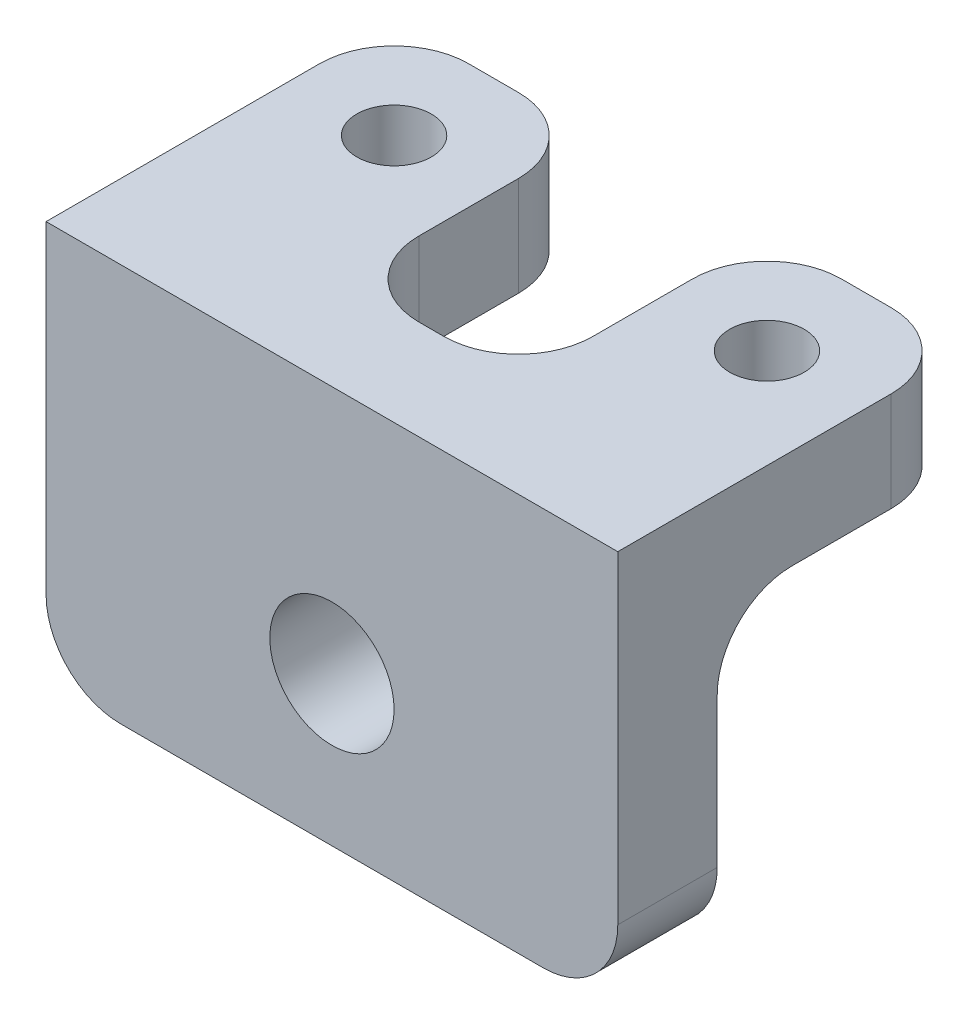
ISO-10303-21;
HEADER;
FILE_DESCRIPTION(('STEP AP214'),'2;1');
FILE_NAME('part.step','',(''),(''),'','','');
FILE_SCHEMA(('AUTOMOTIVE_DESIGN { 1 0 10303 214 1 1 1 1 }'));
ENDSEC;
DATA;
#1=APPLICATION_CONTEXT('core data for automotive mechanical design processes');
#2=APPLICATION_PROTOCOL_DEFINITION('international standard','automotive_design',2000,#1);
#3=PRODUCT_CONTEXT('',#1,'mechanical');
#4=PRODUCT('Part','Part','',(#3));
#5=PRODUCT_RELATED_PRODUCT_CATEGORY('part','',(#4));
#6=PRODUCT_DEFINITION_FORMATION('','',#4);
#7=PRODUCT_DEFINITION_CONTEXT('part definition',#1,'design');
#8=PRODUCT_DEFINITION('design','',#6,#7);
#9=PRODUCT_DEFINITION_SHAPE('','',#8);
#10=(LENGTH_UNIT() NAMED_UNIT(*) SI_UNIT(.MILLI.,.METRE.));
#11=(NAMED_UNIT(*) PLANE_ANGLE_UNIT() SI_UNIT($,.RADIAN.));
#12=(NAMED_UNIT(*) SI_UNIT($,.STERADIAN.) SOLID_ANGLE_UNIT());
#13=UNCERTAINTY_MEASURE_WITH_UNIT(LENGTH_MEASURE(1.E-05),#10,'distance_accuracy_value','');
#14=(GEOMETRIC_REPRESENTATION_CONTEXT(3) GLOBAL_UNCERTAINTY_ASSIGNED_CONTEXT((#13)) GLOBAL_UNIT_ASSIGNED_CONTEXT((#10,
#11,#12)) REPRESENTATION_CONTEXT('',''));
#15=CARTESIAN_POINT('',(0.,0.,0.));
#16=DIRECTION('',(0.,0.,1.));
#17=DIRECTION('',(1.,0.,0.));
#18=AXIS2_PLACEMENT_3D('',#15,#16,#17);
#19=CARTESIAN_POINT('',(0.,0.,0.));
#20=DIRECTION('',(0.,1.,0.));
#21=DIRECTION('',(0.,0.,1.));
#22=AXIS2_PLACEMENT_3D('',#19,#20,#21);
#23=PLANE('',#22);
#24=CARTESIAN_POINT('',(7.5,0.,-6.));
#25=DIRECTION('',(0.,1.,0.));
#26=DIRECTION('',(0.,0.,1.));
#27=AXIS2_PLACEMENT_3D('',#24,#25,#26);
#28=CIRCLE('',#27,1.5);
#29=CARTESIAN_POINT('',(7.5,0.,-4.5));
#30=VERTEX_POINT('',#29);
#31=EDGE_CURVE('E351',#30,#30,#28,.T.);
#32=ORIENTED_EDGE('',*,*,#31,.T.);
#33=EDGE_LOOP('',(#32));
#34=FACE_BOUND('',#33,.T.);
#35=DIRECTION('',(0.,0.,-1.));
#36=VECTOR('',#35,1.);
#37=CARTESIAN_POINT('',(11.5,0.,-10.));
#38=LINE('',#37,#36);
#39=CARTESIAN_POINT('',(11.5,0.,-3.));
#40=VERTEX_POINT('',#39);
#41=CARTESIAN_POINT('',(11.5,0.,-7.));
#42=VERTEX_POINT('',#41);
#43=EDGE_CURVE('E218',#40,#42,#38,.T.);
#44=ORIENTED_EDGE('',*,*,#43,.F.);
#45=DIRECTION('',(-1.,0.,0.));
#46=VECTOR('',#45,1.);
#47=CARTESIAN_POINT('',(3.5,0.,-3.));
#48=LINE('',#47,#46);
#49=CARTESIAN_POINT('',(3.5,0.,-3.));
#50=VERTEX_POINT('',#49);
#51=EDGE_CURVE('E250',#40,#50,#48,.T.);
#52=ORIENTED_EDGE('',*,*,#51,.T.);
#53=DIRECTION('',(0.,0.,1.));
#54=VECTOR('',#53,1.);
#55=CARTESIAN_POINT('',(3.5,0.,0.));
#56=LINE('',#55,#54);
#57=CARTESIAN_POINT('',(3.5,0.,-7.));
#58=VERTEX_POINT('',#57);
#59=EDGE_CURVE('E223',#58,#50,#56,.T.);
#60=ORIENTED_EDGE('',*,*,#59,.F.);
#61=CARTESIAN_POINT('',(6.5,0.,-7.));
#62=DIRECTION('',(0.,1.,0.));
#63=DIRECTION('',(0.,0.,1.));
#64=AXIS2_PLACEMENT_3D('',#61,#62,#63);
#65=CIRCLE('',#64,3.);
#66=CARTESIAN_POINT('',(6.5,0.,-10.));
#67=VERTEX_POINT('',#66);
#68=EDGE_CURVE('E248',#58,#67,#65,.F.);
#69=ORIENTED_EDGE('',*,*,#68,.T.);
#70=DIRECTION('',(-1.,0.,0.));
#71=VECTOR('',#70,1.);
#72=CARTESIAN_POINT('',(3.5,0.,-10.));
#73=LINE('',#72,#71);
#74=CARTESIAN_POINT('',(8.5,0.,-10.));
#75=VERTEX_POINT('',#74);
#76=EDGE_CURVE('E221',#75,#67,#73,.T.);
#77=ORIENTED_EDGE('',*,*,#76,.F.);
#78=CARTESIAN_POINT('',(8.5,0.,-7.));
#79=DIRECTION('',(0.,1.,0.));
#80=DIRECTION('',(0.,0.,1.));
#81=AXIS2_PLACEMENT_3D('',#78,#79,#80);
#82=CIRCLE('',#81,3.);
#83=EDGE_CURVE('E246',#75,#42,#82,.F.);
#84=ORIENTED_EDGE('',*,*,#83,.T.);
#85=EDGE_LOOP('',(#44,#52,#60,#69,#77,#84));
#86=FACE_BOUND('',#85,.T.);
#87=ADVANCED_FACE('F33',(#34,#86),#23,.F.);
#88=CARTESIAN_POINT('',(0.,4.,0.));
#89=DIRECTION('',(0.,1.,0.));
#90=DIRECTION('',(0.,0.,1.));
#91=AXIS2_PLACEMENT_3D('',#88,#89,#90);
#92=PLANE('',#91);
#93=CARTESIAN_POINT('',(-7.5,4.,-6.));
#94=DIRECTION('',(0.,1.,0.));
#95=DIRECTION('',(0.,0.,1.));
#96=AXIS2_PLACEMENT_3D('',#93,#94,#95);
#97=CIRCLE('',#96,1.5);
#98=CARTESIAN_POINT('',(-7.5,4.,-4.5));
#99=VERTEX_POINT('',#98);
#100=EDGE_CURVE('E212',#99,#99,#97,.T.);
#101=ORIENTED_EDGE('',*,*,#100,.F.);
#102=EDGE_LOOP('',(#101));
#103=FACE_BOUND('',#102,.T.);
#104=DIRECTION('',(-1.,0.,0.));
#105=VECTOR('',#104,1.);
#106=CARTESIAN_POINT('',(-11.5,4.,-10.));
#107=LINE('',#106,#105);
#108=CARTESIAN_POINT('',(-6.5,4.,-10.));
#109=VERTEX_POINT('',#108);
#110=CARTESIAN_POINT('',(-8.5,4.,-10.));
#111=VERTEX_POINT('',#110);
#112=EDGE_CURVE('E178',#109,#111,#107,.T.);
#113=ORIENTED_EDGE('',*,*,#112,.T.);
#114=CARTESIAN_POINT('',(-8.5,4.,-7.));
#115=DIRECTION('',(0.,1.,0.));
#116=DIRECTION('',(0.,0.,1.));
#117=AXIS2_PLACEMENT_3D('',#114,#115,#116);
#118=CIRCLE('',#117,3.);
#119=CARTESIAN_POINT('',(-11.5,4.,-7.));
#120=VERTEX_POINT('',#119);
#121=EDGE_CURVE('E174',#111,#120,#118,.T.);
#122=ORIENTED_EDGE('',*,*,#121,.T.);
#123=DIRECTION('',(0.,0.,1.));
#124=VECTOR('',#123,1.);
#125=CARTESIAN_POINT('',(-11.5,4.,4.));
#126=LINE('',#125,#124);
#127=CARTESIAN_POINT('',(-11.5,4.,4.));
#128=VERTEX_POINT('',#127);
#129=EDGE_CURVE('E165',#120,#128,#126,.T.);
#130=ORIENTED_EDGE('',*,*,#129,.T.);
#131=DIRECTION('',(1.,0.,0.));
#132=VECTOR('',#131,1.);
#133=CARTESIAN_POINT('',(11.5,4.,4.));
#134=LINE('',#133,#132);
#135=CARTESIAN_POINT('',(11.5,4.,4.));
#136=VERTEX_POINT('',#135);
#137=EDGE_CURVE('E171',#128,#136,#134,.T.);
#138=ORIENTED_EDGE('',*,*,#137,.T.);
#139=DIRECTION('',(0.,0.,-1.));
#140=VECTOR('',#139,1.);
#141=CARTESIAN_POINT('',(11.5,4.,-10.));
#142=LINE('',#141,#140);
#143=CARTESIAN_POINT('',(11.5,4.,-7.));
#144=VERTEX_POINT('',#143);
#145=EDGE_CURVE('E195',#136,#144,#142,.T.);
#146=ORIENTED_EDGE('',*,*,#145,.T.);
#147=CARTESIAN_POINT('',(8.5,4.,-7.));
#148=DIRECTION('',(0.,1.,0.));
#149=DIRECTION('',(0.,0.,1.));
#150=AXIS2_PLACEMENT_3D('',#147,#148,#149);
#151=CIRCLE('',#150,3.);
#152=CARTESIAN_POINT('',(8.5,4.,-10.));
#153=VERTEX_POINT('',#152);
#154=EDGE_CURVE('E57',#144,#153,#151,.T.);
#155=ORIENTED_EDGE('',*,*,#154,.T.);
#156=DIRECTION('',(-1.,0.,0.));
#157=VECTOR('',#156,1.);
#158=CARTESIAN_POINT('',(3.5,4.,-10.));
#159=LINE('',#158,#157);
#160=CARTESIAN_POINT('',(6.5,4.,-10.));
#161=VERTEX_POINT('',#160);
#162=EDGE_CURVE('E197',#153,#161,#159,.T.);
#163=ORIENTED_EDGE('',*,*,#162,.T.);
#164=CARTESIAN_POINT('',(6.5,4.,-7.));
#165=DIRECTION('',(0.,1.,0.));
#166=DIRECTION('',(0.,0.,1.));
#167=AXIS2_PLACEMENT_3D('',#164,#165,#166);
#168=CIRCLE('',#167,3.);
#169=CARTESIAN_POINT('',(3.5,4.,-7.));
#170=VERTEX_POINT('',#169);
#171=EDGE_CURVE('E284',#161,#170,#168,.T.);
#172=ORIENTED_EDGE('',*,*,#171,.T.);
#173=DIRECTION('',(0.,0.,1.));
#174=VECTOR('',#173,1.);
#175=CARTESIAN_POINT('',(3.5,4.,0.));
#176=LINE('',#175,#174);
#177=CARTESIAN_POINT('',(3.5,4.,-3.));
#178=VERTEX_POINT('',#177);
#179=EDGE_CURVE('E202',#170,#178,#176,.T.);
#180=ORIENTED_EDGE('',*,*,#179,.T.);
#181=CARTESIAN_POINT('',(0.5,4.,-3.));
#182=DIRECTION('',(0.,1.,0.));
#183=DIRECTION('',(0.,0.,1.));
#184=AXIS2_PLACEMENT_3D('',#181,#182,#183);
#185=CIRCLE('',#184,3.);
#186=CARTESIAN_POINT('',(0.5,4.,0.));
#187=VERTEX_POINT('',#186);
#188=EDGE_CURVE('E42',#178,#187,#185,.F.);
#189=ORIENTED_EDGE('',*,*,#188,.T.);
#190=DIRECTION('',(-1.,0.,0.));
#191=VECTOR('',#190,1.);
#192=CARTESIAN_POINT('',(-3.5,4.,0.));
#193=LINE('',#192,#191);
#194=CARTESIAN_POINT('',(-0.499999999999999,4.,0.));
#195=VERTEX_POINT('',#194);
#196=EDGE_CURVE('E205',#187,#195,#193,.T.);
#197=ORIENTED_EDGE('',*,*,#196,.T.);
#198=CARTESIAN_POINT('',(-0.499999999999999,4.,-3.));
#199=DIRECTION('',(0.,1.,0.));
#200=DIRECTION('',(0.,0.,1.));
#201=AXIS2_PLACEMENT_3D('',#198,#199,#200);
#202=CIRCLE('',#201,3.);
#203=CARTESIAN_POINT('',(-3.5,4.,-3.));
#204=VERTEX_POINT('',#203);
#205=EDGE_CURVE('E11',#195,#204,#202,.F.);
#206=ORIENTED_EDGE('',*,*,#205,.T.);
#207=DIRECTION('',(0.,0.,-1.));
#208=VECTOR('',#207,1.);
#209=CARTESIAN_POINT('',(-3.5,4.,-10.));
#210=LINE('',#209,#208);
#211=CARTESIAN_POINT('',(-3.5,4.,-7.));
#212=VERTEX_POINT('',#211);
#213=EDGE_CURVE('E226',#204,#212,#210,.T.);
#214=ORIENTED_EDGE('',*,*,#213,.T.);
#215=CARTESIAN_POINT('',(-6.5,4.,-7.));
#216=DIRECTION('',(0.,1.,0.));
#217=DIRECTION('',(0.,0.,1.));
#218=AXIS2_PLACEMENT_3D('',#215,#216,#217);
#219=CIRCLE('',#218,3.);
#220=EDGE_CURVE('E286',#212,#109,#219,.T.);
#221=ORIENTED_EDGE('',*,*,#220,.T.);
#222=EDGE_LOOP('',(#113,#122,#130,#138,#146,#155,#163,#172,#180,#189,#197,#206,#214,#221));
#223=FACE_BOUND('',#222,.T.);
#224=CARTESIAN_POINT('',(7.5,4.,-6.));
#225=DIRECTION('',(0.,1.,0.));
#226=DIRECTION('',(0.,0.,1.));
#227=AXIS2_PLACEMENT_3D('',#224,#225,#226);
#228=CIRCLE('',#227,1.5);
#229=CARTESIAN_POINT('',(7.5,4.,-4.5));
#230=VERTEX_POINT('',#229);
#231=EDGE_CURVE('E353',#230,#230,#228,.T.);
#232=ORIENTED_EDGE('',*,*,#231,.F.);
#233=EDGE_LOOP('',(#232));
#234=FACE_BOUND('',#233,.T.);
#235=ADVANCED_FACE('F168',(#103,#223,#234),#92,.T.);
#236=DIRECTION('',(0.,0.,-1.));
#237=VECTOR('',#236,1.);
#238=CARTESIAN_POINT('',(-3.5,0.,-10.));
#239=LINE('',#238,#237);
#240=CARTESIAN_POINT('',(-3.5,0.,-3.));
#241=VERTEX_POINT('',#240);
#242=CARTESIAN_POINT('',(-3.5,0.,-7.));
#243=VERTEX_POINT('',#242);
#244=EDGE_CURVE('E208',#241,#243,#239,.T.);
#245=ORIENTED_EDGE('',*,*,#244,.F.);
#246=DIRECTION('',(-1.,0.,0.));
#247=VECTOR('',#246,1.);
#248=CARTESIAN_POINT('',(-11.5,0.,-3.));
#249=LINE('',#248,#247);
#250=CARTESIAN_POINT('',(-11.5,0.,-3.));
#251=VERTEX_POINT('',#250);
#252=EDGE_CURVE('E231',#241,#251,#249,.T.);
#253=ORIENTED_EDGE('',*,*,#252,.T.);
#254=DIRECTION('',(0.,0.,1.));
#255=VECTOR('',#254,1.);
#256=CARTESIAN_POINT('',(-11.5,0.,4.));
#257=LINE('',#256,#255);
#258=CARTESIAN_POINT('',(-11.5,0.,-7.));
#259=VERTEX_POINT('',#258);
#260=EDGE_CURVE('E215',#259,#251,#257,.T.);
#261=ORIENTED_EDGE('',*,*,#260,.F.);
#262=CARTESIAN_POINT('',(-8.5,0.,-7.));
#263=DIRECTION('',(0.,1.,0.));
#264=DIRECTION('',(0.,0.,1.));
#265=AXIS2_PLACEMENT_3D('',#262,#263,#264);
#266=CIRCLE('',#265,3.);
#267=CARTESIAN_POINT('',(-8.5,0.,-10.));
#268=VERTEX_POINT('',#267);
#269=EDGE_CURVE('E229',#259,#268,#266,.F.);
#270=ORIENTED_EDGE('',*,*,#269,.T.);
#271=DIRECTION('',(-1.,0.,0.));
#272=VECTOR('',#271,1.);
#273=CARTESIAN_POINT('',(-11.5,0.,-10.));
#274=LINE('',#273,#272);
#275=CARTESIAN_POINT('',(-6.5,0.,-10.));
#276=VERTEX_POINT('',#275);
#277=EDGE_CURVE('E211',#276,#268,#274,.T.);
#278=ORIENTED_EDGE('',*,*,#277,.F.);
#279=CARTESIAN_POINT('',(-6.5,0.,-7.));
#280=DIRECTION('',(0.,1.,0.));
#281=DIRECTION('',(0.,0.,1.));
#282=AXIS2_PLACEMENT_3D('',#279,#280,#281);
#283=CIRCLE('',#282,3.);
#284=EDGE_CURVE('E188',#276,#243,#283,.F.);
#285=ORIENTED_EDGE('',*,*,#284,.T.);
#286=EDGE_LOOP('',(#245,#253,#261,#270,#278,#285));
#287=FACE_BOUND('',#286,.T.);
#288=CARTESIAN_POINT('',(-7.5,0.,-6.));
#289=DIRECTION('',(0.,1.,0.));
#290=DIRECTION('',(0.,0.,1.));
#291=AXIS2_PLACEMENT_3D('',#288,#289,#290);
#292=CIRCLE('',#291,1.5);
#293=CARTESIAN_POINT('',(-7.5,0.,-4.5));
#294=VERTEX_POINT('',#293);
#295=EDGE_CURVE('E356',#294,#294,#292,.T.);
#296=ORIENTED_EDGE('',*,*,#295,.T.);
#297=EDGE_LOOP('',(#296));
#298=FACE_BOUND('',#297,.T.);
#299=ADVANCED_FACE('F374',(#287,#298),#23,.F.);
#300=CARTESIAN_POINT('',(-3.5,4.,-10.));
#301=DIRECTION('',(-1.,0.,0.));
#302=DIRECTION('',(0.,0.,1.));
#303=AXIS2_PLACEMENT_3D('',#300,#301,#302);
#304=PLANE('',#303);
#305=ORIENTED_EDGE('',*,*,#213,.F.);
#306=DIRECTION('',(0.,-1.,0.));
#307=VECTOR('',#306,1.);
#308=CARTESIAN_POINT('',(-3.5,0.,-3.));
#309=LINE('',#308,#307);
#310=EDGE_CURVE('E276',#204,#241,#309,.T.);
#311=ORIENTED_EDGE('',*,*,#310,.T.);
#312=ORIENTED_EDGE('',*,*,#244,.T.);
#313=DIRECTION('',(0.,-1.,0.));
#314=VECTOR('',#313,1.);
#315=CARTESIAN_POINT('',(-3.5,4.,-7.));
#316=LINE('',#315,#314);
#317=EDGE_CURVE('E274',#243,#212,#316,.F.);
#318=ORIENTED_EDGE('',*,*,#317,.T.);
#319=EDGE_LOOP('',(#305,#311,#312,#318));
#320=FACE_BOUND('',#319,.T.);
#321=ADVANCED_FACE('F412',(#320),#304,.F.);
#322=CARTESIAN_POINT('',(-11.5,4.,-10.));
#323=DIRECTION('',(0.,0.,1.));
#324=DIRECTION('',(1.,0.,0.));
#325=AXIS2_PLACEMENT_3D('',#322,#323,#324);
#326=PLANE('',#325);
#327=ORIENTED_EDGE('',*,*,#277,.T.);
#328=DIRECTION('',(0.,-1.,0.));
#329=VECTOR('',#328,1.);
#330=CARTESIAN_POINT('',(-8.5,4.,-10.));
#331=LINE('',#330,#329);
#332=EDGE_CURVE('E281',#268,#111,#331,.F.);
#333=ORIENTED_EDGE('',*,*,#332,.T.);
#334=ORIENTED_EDGE('',*,*,#112,.F.);
#335=DIRECTION('',(0.,-1.,0.));
#336=VECTOR('',#335,1.);
#337=CARTESIAN_POINT('',(-6.5,4.,-10.));
#338=LINE('',#337,#336);
#339=EDGE_CURVE('E278',#109,#276,#338,.T.);
#340=ORIENTED_EDGE('',*,*,#339,.T.);
#341=EDGE_LOOP('',(#327,#333,#334,#340));
#342=FACE_BOUND('',#341,.T.);
#343=ADVANCED_FACE('F416',(#342),#326,.F.);
#344=CARTESIAN_POINT('',(-11.5,4.,4.));
#345=DIRECTION('',(1.,0.,0.));
#346=DIRECTION('',(0.,0.,-1.));
#347=AXIS2_PLACEMENT_3D('',#344,#345,#346);
#348=PLANE('',#347);
#349=DIRECTION('',(0.,-1.,0.));
#350=VECTOR('',#349,1.);
#351=CARTESIAN_POINT('',(-11.5,0.,0.));
#352=LINE('',#351,#350);
#353=CARTESIAN_POINT('',(-11.5,-3.,0.));
#354=VERTEX_POINT('',#353);
#355=CARTESIAN_POINT('',(-11.5,-9.,0.));
#356=VERTEX_POINT('',#355);
#357=EDGE_CURVE('E341',#354,#356,#352,.T.);
#358=ORIENTED_EDGE('',*,*,#357,.T.);
#359=DIRECTION('',(0.,0.,1.));
#360=VECTOR('',#359,1.);
#361=CARTESIAN_POINT('',(-11.5,-9.,4.));
#362=LINE('',#361,#360);
#363=CARTESIAN_POINT('',(-11.5,-9.,4.));
#364=VERTEX_POINT('',#363);
#365=EDGE_CURVE('E186',#356,#364,#362,.T.);
#366=ORIENTED_EDGE('',*,*,#365,.T.);
#367=DIRECTION('',(0.,-1.,0.));
#368=VECTOR('',#367,1.);
#369=CARTESIAN_POINT('',(-11.5,4.,4.));
#370=LINE('',#369,#368);
#371=EDGE_CURVE('E182',#128,#364,#370,.T.);
#372=ORIENTED_EDGE('',*,*,#371,.F.);
#373=ORIENTED_EDGE('',*,*,#129,.F.);
#374=DIRECTION('',(0.,-1.,0.));
#375=VECTOR('',#374,1.);
#376=CARTESIAN_POINT('',(-11.5,4.,-7.));
#377=LINE('',#376,#375);
#378=EDGE_CURVE('E253',#120,#259,#377,.T.);
#379=ORIENTED_EDGE('',*,*,#378,.T.);
#380=ORIENTED_EDGE('',*,*,#260,.T.);
#381=CARTESIAN_POINT('',(-11.5,-3.,-3.));
#382=DIRECTION('',(1.,0.,0.));
#383=DIRECTION('',(0.,0.,-1.));
#384=AXIS2_PLACEMENT_3D('',#381,#382,#383);
#385=CIRCLE('',#384,3.);
#386=EDGE_CURVE('E293',#251,#354,#385,.T.);
#387=ORIENTED_EDGE('',*,*,#386,.T.);
#388=EDGE_LOOP('',(#358,#366,#372,#373,#379,#380,#387));
#389=FACE_BOUND('',#388,.T.);
#390=ADVANCED_FACE('F184',(#389),#348,.F.);
#391=CARTESIAN_POINT('',(11.5,4.,4.));
#392=DIRECTION('',(0.,0.,-1.));
#393=DIRECTION('',(-1.,0.,0.));
#394=AXIS2_PLACEMENT_3D('',#391,#392,#393);
#395=PLANE('',#394);
#396=ORIENTED_EDGE('',*,*,#371,.T.);
#397=CARTESIAN_POINT('',(-8.5,-9.,4.));
#398=DIRECTION('',(0.,0.,-1.));
#399=DIRECTION('',(-1.,0.,0.));
#400=AXIS2_PLACEMENT_3D('',#397,#398,#399);
#401=CIRCLE('',#400,3.);
#402=CARTESIAN_POINT('',(-8.5,-12.,4.));
#403=VERTEX_POINT('',#402);
#404=EDGE_CURVE('E258',#364,#403,#401,.F.);
#405=ORIENTED_EDGE('',*,*,#404,.T.);
#406=DIRECTION('',(1.,0.,0.));
#407=VECTOR('',#406,1.);
#408=CARTESIAN_POINT('',(11.5,-12.,4.));
#409=LINE('',#408,#407);
#410=CARTESIAN_POINT('',(8.5,-12.,4.));
#411=VERTEX_POINT('',#410);
#412=EDGE_CURVE('E342',#403,#411,#409,.T.);
#413=ORIENTED_EDGE('',*,*,#412,.T.);
#414=CARTESIAN_POINT('',(8.5,-9.,4.));
#415=DIRECTION('',(0.,0.,-1.));
#416=DIRECTION('',(-1.,0.,0.));
#417=AXIS2_PLACEMENT_3D('',#414,#415,#416);
#418=CIRCLE('',#417,3.);
#419=CARTESIAN_POINT('',(11.5,-9.,4.));
#420=VERTEX_POINT('',#419);
#421=EDGE_CURVE('E256',#411,#420,#418,.F.);
#422=ORIENTED_EDGE('',*,*,#421,.T.);
#423=DIRECTION('',(0.,-1.,0.));
#424=VECTOR('',#423,1.);
#425=CARTESIAN_POINT('',(11.5,4.,4.));
#426=LINE('',#425,#424);
#427=EDGE_CURVE('E189',#136,#420,#426,.T.);
#428=ORIENTED_EDGE('',*,*,#427,.F.);
#429=ORIENTED_EDGE('',*,*,#137,.F.);
#430=EDGE_LOOP('',(#396,#405,#413,#422,#428,#429));
#431=FACE_BOUND('',#430,.T.);
#432=CARTESIAN_POINT('',(0.,-6.,4.));
#433=DIRECTION('',(0.,0.,1.));
#434=DIRECTION('',(1.,0.,0.));
#435=AXIS2_PLACEMENT_3D('',#432,#433,#434);
#436=CIRCLE('',#435,2.5);
#437=CARTESIAN_POINT('',(2.5,-6.,4.));
#438=VERTEX_POINT('',#437);
#439=EDGE_CURVE('E299',#438,#438,#436,.T.);
#440=ORIENTED_EDGE('',*,*,#439,.F.);
#441=EDGE_LOOP('',(#440));
#442=FACE_BOUND('',#441,.T.);
#443=ADVANCED_FACE('F191',(#431,#442),#395,.F.);
#444=CARTESIAN_POINT('',(11.5,4.,-10.));
#445=DIRECTION('',(-1.,0.,0.));
#446=DIRECTION('',(0.,0.,1.));
#447=AXIS2_PLACEMENT_3D('',#444,#445,#446);
#448=PLANE('',#447);
#449=ORIENTED_EDGE('',*,*,#427,.T.);
#450=DIRECTION('',(0.,0.,1.));
#451=VECTOR('',#450,1.);
#452=CARTESIAN_POINT('',(11.5,-9.,0.));
#453=LINE('',#452,#451);
#454=CARTESIAN_POINT('',(11.5,-9.,0.));
#455=VERTEX_POINT('',#454);
#456=EDGE_CURVE('E267',#420,#455,#453,.F.);
#457=ORIENTED_EDGE('',*,*,#456,.T.);
#458=DIRECTION('',(0.,1.,0.));
#459=VECTOR('',#458,1.);
#460=CARTESIAN_POINT('',(11.5,0.,0.));
#461=LINE('',#460,#459);
#462=CARTESIAN_POINT('',(11.5,-3.,0.));
#463=VERTEX_POINT('',#462);
#464=EDGE_CURVE('E337',#455,#463,#461,.T.);
#465=ORIENTED_EDGE('',*,*,#464,.T.);
#466=CARTESIAN_POINT('',(11.5,-3.,-3.));
#467=DIRECTION('',(-1.,0.,0.));
#468=DIRECTION('',(0.,0.,1.));
#469=AXIS2_PLACEMENT_3D('',#466,#467,#468);
#470=CIRCLE('',#469,3.);
#471=EDGE_CURVE('E295',#463,#40,#470,.T.);
#472=ORIENTED_EDGE('',*,*,#471,.T.);
#473=ORIENTED_EDGE('',*,*,#43,.T.);
#474=DIRECTION('',(0.,-1.,0.));
#475=VECTOR('',#474,1.);
#476=CARTESIAN_POINT('',(11.5,4.,-7.));
#477=LINE('',#476,#475);
#478=EDGE_CURVE('E265',#42,#144,#477,.F.);
#479=ORIENTED_EDGE('',*,*,#478,.T.);
#480=ORIENTED_EDGE('',*,*,#145,.F.);
#481=EDGE_LOOP('',(#449,#457,#465,#472,#473,#479,#480));
#482=FACE_BOUND('',#481,.T.);
#483=ADVANCED_FACE('F334',(#482),#448,.F.);
#484=CARTESIAN_POINT('',(3.5,4.,-10.));
#485=DIRECTION('',(0.,0.,1.));
#486=DIRECTION('',(1.,0.,0.));
#487=AXIS2_PLACEMENT_3D('',#484,#485,#486);
#488=PLANE('',#487);
#489=ORIENTED_EDGE('',*,*,#76,.T.);
#490=DIRECTION('',(0.,-1.,0.));
#491=VECTOR('',#490,1.);
#492=CARTESIAN_POINT('',(6.5,4.,-10.));
#493=LINE('',#492,#491);
#494=EDGE_CURVE('E50',#67,#161,#493,.F.);
#495=ORIENTED_EDGE('',*,*,#494,.T.);
#496=ORIENTED_EDGE('',*,*,#162,.F.);
#497=DIRECTION('',(0.,-1.,0.));
#498=VECTOR('',#497,1.);
#499=CARTESIAN_POINT('',(8.5,4.,-10.));
#500=LINE('',#499,#498);
#501=EDGE_CURVE('E289',#153,#75,#500,.T.);
#502=ORIENTED_EDGE('',*,*,#501,.T.);
#503=EDGE_LOOP('',(#489,#495,#496,#502));
#504=FACE_BOUND('',#503,.T.);
#505=ADVANCED_FACE('F329',(#504),#488,.F.);
#506=CARTESIAN_POINT('',(3.5,4.,0.));
#507=DIRECTION('',(1.,0.,0.));
#508=DIRECTION('',(0.,0.,-1.));
#509=AXIS2_PLACEMENT_3D('',#506,#507,#508);
#510=PLANE('',#509);
#511=ORIENTED_EDGE('',*,*,#59,.T.);
#512=DIRECTION('',(0.,-1.,0.));
#513=VECTOR('',#512,1.);
#514=CARTESIAN_POINT('',(3.5,4.,-3.));
#515=LINE('',#514,#513);
#516=EDGE_CURVE('E272',#50,#178,#515,.F.);
#517=ORIENTED_EDGE('',*,*,#516,.T.);
#518=ORIENTED_EDGE('',*,*,#179,.F.);
#519=DIRECTION('',(0.,-1.,0.));
#520=VECTOR('',#519,1.);
#521=CARTESIAN_POINT('',(3.5,4.,-7.));
#522=LINE('',#521,#520);
#523=EDGE_CURVE('E269',#170,#58,#522,.T.);
#524=ORIENTED_EDGE('',*,*,#523,.T.);
#525=EDGE_LOOP('',(#511,#517,#518,#524));
#526=FACE_BOUND('',#525,.T.);
#527=ADVANCED_FACE('F323',(#526),#510,.F.);
#528=CARTESIAN_POINT('',(-3.5,4.,0.));
#529=DIRECTION('',(0.,0.,1.));
#530=DIRECTION('',(1.,0.,0.));
#531=AXIS2_PLACEMENT_3D('',#528,#529,#530);
#532=PLANE('',#531);
#533=DIRECTION('',(1.,0.,0.));
#534=VECTOR('',#533,1.);
#535=CARTESIAN_POINT('',(11.5,-12.,0.));
#536=LINE('',#535,#534);
#537=CARTESIAN_POINT('',(-8.5,-12.,0.));
#538=VERTEX_POINT('',#537);
#539=CARTESIAN_POINT('',(8.5,-12.,0.));
#540=VERTEX_POINT('',#539);
#541=EDGE_CURVE('E344',#538,#540,#536,.T.);
#542=ORIENTED_EDGE('',*,*,#541,.F.);
#543=CARTESIAN_POINT('',(-8.5,-9.,0.));
#544=DIRECTION('',(0.,0.,1.));
#545=DIRECTION('',(1.,0.,0.));
#546=AXIS2_PLACEMENT_3D('',#543,#544,#545);
#547=CIRCLE('',#546,3.);
#548=EDGE_CURVE('E244',#538,#356,#547,.F.);
#549=ORIENTED_EDGE('',*,*,#548,.T.);
#550=ORIENTED_EDGE('',*,*,#357,.F.);
#551=DIRECTION('',(-1.,0.,0.));
#552=VECTOR('',#551,1.);
#553=CARTESIAN_POINT('',(-3.5,-3.,0.));
#554=LINE('',#553,#552);
#555=CARTESIAN_POINT('',(-0.499999999999999,-3.,0.));
#556=VERTEX_POINT('',#555);
#557=EDGE_CURVE('E236',#354,#556,#554,.F.);
#558=ORIENTED_EDGE('',*,*,#557,.T.);
#559=DIRECTION('',(0.,-1.,0.));
#560=VECTOR('',#559,1.);
#561=CARTESIAN_POINT('',(-0.499999999999999,4.,0.));
#562=LINE('',#561,#560);
#563=EDGE_CURVE('E234',#556,#195,#562,.F.);
#564=ORIENTED_EDGE('',*,*,#563,.T.);
#565=ORIENTED_EDGE('',*,*,#196,.F.);
#566=DIRECTION('',(0.,-1.,0.));
#567=VECTOR('',#566,1.);
#568=CARTESIAN_POINT('',(0.5,0.,0.));
#569=LINE('',#568,#567);
#570=CARTESIAN_POINT('',(0.5,-3.,0.));
#571=VERTEX_POINT('',#570);
#572=EDGE_CURVE('E238',#187,#571,#569,.T.);
#573=ORIENTED_EDGE('',*,*,#572,.T.);
#574=DIRECTION('',(-1.,0.,0.));
#575=VECTOR('',#574,1.);
#576=CARTESIAN_POINT('',(11.5,-3.,0.));
#577=LINE('',#576,#575);
#578=EDGE_CURVE('E240',#571,#463,#577,.F.);
#579=ORIENTED_EDGE('',*,*,#578,.T.);
#580=ORIENTED_EDGE('',*,*,#464,.F.);
#581=CARTESIAN_POINT('',(8.5,-9.,0.));
#582=DIRECTION('',(0.,0.,1.));
#583=DIRECTION('',(1.,0.,0.));
#584=AXIS2_PLACEMENT_3D('',#581,#582,#583);
#585=CIRCLE('',#584,3.);
#586=EDGE_CURVE('E242',#455,#540,#585,.F.);
#587=ORIENTED_EDGE('',*,*,#586,.T.);
#588=EDGE_LOOP('',(#542,#549,#550,#558,#564,#565,#573,#579,#580,#587));
#589=FACE_BOUND('',#588,.T.);
#590=CARTESIAN_POINT('',(0.,-6.,0.));
#591=DIRECTION('',(0.,0.,1.));
#592=DIRECTION('',(1.,0.,0.));
#593=AXIS2_PLACEMENT_3D('',#590,#591,#592);
#594=CIRCLE('',#593,2.5);
#595=CARTESIAN_POINT('',(2.5,-6.,0.));
#596=VERTEX_POINT('',#595);
#597=EDGE_CURVE('E305',#596,#596,#594,.T.);
#598=ORIENTED_EDGE('',*,*,#597,.T.);
#599=EDGE_LOOP('',(#598));
#600=FACE_BOUND('',#599,.T.);
#601=ADVANCED_FACE('F380',(#589,#600),#532,.F.);
#602=CARTESIAN_POINT('',(-7.5,4.,-6.));
#603=DIRECTION('',(0.,-1.,0.));
#604=DIRECTION('',(0.,0.,-1.));
#605=AXIS2_PLACEMENT_3D('',#602,#603,#604);
#606=CYLINDRICAL_SURFACE('',#605,1.5);
#607=ORIENTED_EDGE('',*,*,#100,.T.);
#608=EDGE_LOOP('',(#607));
#609=FACE_BOUND('',#608,.T.);
#610=ORIENTED_EDGE('',*,*,#295,.F.);
#611=EDGE_LOOP('',(#610));
#612=FACE_BOUND('',#611,.T.);
#613=ADVANCED_FACE('F526',(#609,#612),#606,.F.);
#614=CARTESIAN_POINT('',(7.5,4.,-6.));
#615=DIRECTION('',(0.,-1.,0.));
#616=DIRECTION('',(0.,0.,-1.));
#617=AXIS2_PLACEMENT_3D('',#614,#615,#616);
#618=CYLINDRICAL_SURFACE('',#617,1.5);
#619=ORIENTED_EDGE('',*,*,#231,.T.);
#620=EDGE_LOOP('',(#619));
#621=FACE_BOUND('',#620,.T.);
#622=ORIENTED_EDGE('',*,*,#31,.F.);
#623=EDGE_LOOP('',(#622));
#624=FACE_BOUND('',#623,.T.);
#625=ADVANCED_FACE('F517',(#621,#624),#618,.F.);
#626=CARTESIAN_POINT('',(11.5,-12.,0.));
#627=DIRECTION('',(0.,-1.,0.));
#628=DIRECTION('',(1.,0.,0.));
#629=AXIS2_PLACEMENT_3D('',#626,#627,#628);
#630=PLANE('',#629);
#631=ORIENTED_EDGE('',*,*,#412,.F.);
#632=DIRECTION('',(0.,0.,1.));
#633=VECTOR('',#632,1.);
#634=CARTESIAN_POINT('',(-8.5,-12.,0.));
#635=LINE('',#634,#633);
#636=EDGE_CURVE('E263',#403,#538,#635,.F.);
#637=ORIENTED_EDGE('',*,*,#636,.T.);
#638=ORIENTED_EDGE('',*,*,#541,.T.);
#639=DIRECTION('',(0.,0.,1.));
#640=VECTOR('',#639,1.);
#641=CARTESIAN_POINT('',(8.5,-12.,4.));
#642=LINE('',#641,#640);
#643=EDGE_CURVE('E260',#540,#411,#642,.T.);
#644=ORIENTED_EDGE('',*,*,#643,.T.);
#645=EDGE_LOOP('',(#631,#637,#638,#644));
#646=FACE_BOUND('',#645,.T.);
#647=ADVANCED_FACE('F389',(#646),#630,.T.);
#648=CARTESIAN_POINT('',(0.,-6.,0.));
#649=DIRECTION('',(0.,0.,1.));
#650=DIRECTION('',(1.,0.,0.));
#651=AXIS2_PLACEMENT_3D('',#648,#649,#650);
#652=CYLINDRICAL_SURFACE('',#651,2.5);
#653=ORIENTED_EDGE('',*,*,#597,.F.);
#654=EDGE_LOOP('',(#653));
#655=FACE_BOUND('',#654,.T.);
#656=ORIENTED_EDGE('',*,*,#439,.T.);
#657=EDGE_LOOP('',(#656));
#658=FACE_BOUND('',#657,.T.);
#659=ADVANCED_FACE('F431',(#655,#658),#652,.F.);
#660=CARTESIAN_POINT('',(-0.499999999999999,4.,-3.));
#661=DIRECTION('',(0.,1.,0.));
#662=DIRECTION('',(0.,0.,1.));
#663=AXIS2_PLACEMENT_3D('',#660,#661,#662);
#664=CYLINDRICAL_SURFACE('',#663,3.);
#665=ORIENTED_EDGE('',*,*,#205,.F.);
#666=ORIENTED_EDGE('',*,*,#563,.F.);
#667=CARTESIAN_POINT('',(-0.499999999999999,-3.,-3.));
#668=DIRECTION('',(0.707106781186547,0.707106781186547,0.));
#669=DIRECTION('',(-0.707106781186547,0.707106781186547,0.));
#670=AXIS2_PLACEMENT_3D('',#667,#668,#669);
#671=ELLIPSE('',#670,4.24264068711928,3.);
#672=EDGE_CURVE('E297',#241,#556,#671,.T.);
#673=ORIENTED_EDGE('',*,*,#672,.F.);
#674=ORIENTED_EDGE('',*,*,#310,.F.);
#675=EDGE_LOOP('',(#665,#666,#673,#674));
#676=FACE_BOUND('',#675,.T.);
#677=ADVANCED_FACE('F428',(#676),#664,.F.);
#678=CARTESIAN_POINT('',(0.,-3.,-3.));
#679=DIRECTION('',(1.,0.,0.));
#680=DIRECTION('',(0.,0.,-1.));
#681=AXIS2_PLACEMENT_3D('',#678,#679,#680);
#682=CYLINDRICAL_SURFACE('',#681,3.);
#683=ORIENTED_EDGE('',*,*,#672,.T.);
#684=ORIENTED_EDGE('',*,*,#557,.F.);
#685=ORIENTED_EDGE('',*,*,#386,.F.);
#686=ORIENTED_EDGE('',*,*,#252,.F.);
#687=EDGE_LOOP('',(#683,#684,#685,#686));
#688=FACE_BOUND('',#687,.T.);
#689=ADVANCED_FACE('F377',(#688),#682,.F.);
#690=CARTESIAN_POINT('',(0.5,4.,-3.));
#691=DIRECTION('',(0.,1.,0.));
#692=DIRECTION('',(0.,0.,1.));
#693=AXIS2_PLACEMENT_3D('',#690,#691,#692);
#694=CYLINDRICAL_SURFACE('',#693,3.);
#695=ORIENTED_EDGE('',*,*,#188,.F.);
#696=ORIENTED_EDGE('',*,*,#516,.F.);
#697=CARTESIAN_POINT('',(0.5,-3.,-3.));
#698=DIRECTION('',(-0.707106781186547,0.707106781186547,0.));
#699=DIRECTION('',(0.707106781186547,0.707106781186547,0.));
#700=AXIS2_PLACEMENT_3D('',#697,#698,#699);
#701=ELLIPSE('',#700,4.24264068711928,3.);
#702=EDGE_CURVE('E37',#571,#50,#701,.T.);
#703=ORIENTED_EDGE('',*,*,#702,.F.);
#704=ORIENTED_EDGE('',*,*,#572,.F.);
#705=EDGE_LOOP('',(#695,#696,#703,#704));
#706=FACE_BOUND('',#705,.T.);
#707=ADVANCED_FACE('F317',(#706),#694,.F.);
#708=CARTESIAN_POINT('',(0.,-3.,-3.));
#709=DIRECTION('',(1.,0.,0.));
#710=DIRECTION('',(0.,0.,-1.));
#711=AXIS2_PLACEMENT_3D('',#708,#709,#710);
#712=CYLINDRICAL_SURFACE('',#711,3.);
#713=ORIENTED_EDGE('',*,*,#471,.F.);
#714=ORIENTED_EDGE('',*,*,#578,.F.);
#715=ORIENTED_EDGE('',*,*,#702,.T.);
#716=ORIENTED_EDGE('',*,*,#51,.F.);
#717=EDGE_LOOP('',(#713,#714,#715,#716));
#718=FACE_BOUND('',#717,.T.);
#719=ADVANCED_FACE('F313',(#718),#712,.F.);
#720=CARTESIAN_POINT('',(-8.5,-9.,4.));
#721=DIRECTION('',(0.,0.,-1.));
#722=DIRECTION('',(-1.,0.,0.));
#723=AXIS2_PLACEMENT_3D('',#720,#721,#722);
#724=CYLINDRICAL_SURFACE('',#723,3.);
#725=ORIENTED_EDGE('',*,*,#548,.F.);
#726=ORIENTED_EDGE('',*,*,#636,.F.);
#727=ORIENTED_EDGE('',*,*,#404,.F.);
#728=ORIENTED_EDGE('',*,*,#365,.F.);
#729=EDGE_LOOP('',(#725,#726,#727,#728));
#730=FACE_BOUND('',#729,.T.);
#731=ADVANCED_FACE('F386',(#730),#724,.T.);
#732=CARTESIAN_POINT('',(8.5,-9.,0.));
#733=DIRECTION('',(0.,0.,-1.));
#734=DIRECTION('',(-1.,0.,0.));
#735=AXIS2_PLACEMENT_3D('',#732,#733,#734);
#736=CYLINDRICAL_SURFACE('',#735,3.);
#737=ORIENTED_EDGE('',*,*,#586,.F.);
#738=ORIENTED_EDGE('',*,*,#456,.F.);
#739=ORIENTED_EDGE('',*,*,#421,.F.);
#740=ORIENTED_EDGE('',*,*,#643,.F.);
#741=EDGE_LOOP('',(#737,#738,#739,#740));
#742=FACE_BOUND('',#741,.T.);
#743=ADVANCED_FACE('F392',(#742),#736,.T.);
#744=CARTESIAN_POINT('',(-8.5,4.,-7.));
#745=DIRECTION('',(0.,-1.,0.));
#746=DIRECTION('',(0.,0.,-1.));
#747=AXIS2_PLACEMENT_3D('',#744,#745,#746);
#748=CYLINDRICAL_SURFACE('',#747,3.);
#749=ORIENTED_EDGE('',*,*,#121,.F.);
#750=ORIENTED_EDGE('',*,*,#332,.F.);
#751=ORIENTED_EDGE('',*,*,#269,.F.);
#752=ORIENTED_EDGE('',*,*,#378,.F.);
#753=EDGE_LOOP('',(#749,#750,#751,#752));
#754=FACE_BOUND('',#753,.T.);
#755=ADVANCED_FACE('F370',(#754),#748,.T.);
#756=CARTESIAN_POINT('',(-6.5,4.,-7.));
#757=DIRECTION('',(0.,-1.,0.));
#758=DIRECTION('',(0.,0.,-1.));
#759=AXIS2_PLACEMENT_3D('',#756,#757,#758);
#760=CYLINDRICAL_SURFACE('',#759,3.);
#761=ORIENTED_EDGE('',*,*,#220,.F.);
#762=ORIENTED_EDGE('',*,*,#317,.F.);
#763=ORIENTED_EDGE('',*,*,#284,.F.);
#764=ORIENTED_EDGE('',*,*,#339,.F.);
#765=EDGE_LOOP('',(#761,#762,#763,#764));
#766=FACE_BOUND('',#765,.T.);
#767=ADVANCED_FACE('F399',(#766),#760,.T.);
#768=CARTESIAN_POINT('',(6.5,4.,-7.));
#769=DIRECTION('',(0.,-1.,0.));
#770=DIRECTION('',(0.,0.,-1.));
#771=AXIS2_PLACEMENT_3D('',#768,#769,#770);
#772=CYLINDRICAL_SURFACE('',#771,3.);
#773=ORIENTED_EDGE('',*,*,#171,.F.);
#774=ORIENTED_EDGE('',*,*,#494,.F.);
#775=ORIENTED_EDGE('',*,*,#68,.F.);
#776=ORIENTED_EDGE('',*,*,#523,.F.);
#777=EDGE_LOOP('',(#773,#774,#775,#776));
#778=FACE_BOUND('',#777,.T.);
#779=ADVANCED_FACE('F327',(#778),#772,.T.);
#780=CARTESIAN_POINT('',(8.5,4.,-7.));
#781=DIRECTION('',(0.,-1.,0.));
#782=DIRECTION('',(0.,0.,-1.));
#783=AXIS2_PLACEMENT_3D('',#780,#781,#782);
#784=CYLINDRICAL_SURFACE('',#783,3.);
#785=ORIENTED_EDGE('',*,*,#154,.F.);
#786=ORIENTED_EDGE('',*,*,#478,.F.);
#787=ORIENTED_EDGE('',*,*,#83,.F.);
#788=ORIENTED_EDGE('',*,*,#501,.F.);
#789=EDGE_LOOP('',(#785,#786,#787,#788));
#790=FACE_BOUND('',#789,.T.);
#791=ADVANCED_FACE('F35',(#790),#784,.T.);
#792=CLOSED_SHELL('',(#87,#235,#299,#321,#343,#390,#443,#483,#505,#527,#601,#613,#625,#647,#659,
#677,#689,#707,#719,#731,#743,#755,#767,#779,#791));
#793=MANIFOLD_SOLID_BREP('B2',#792);
#794=ADVANCED_BREP_SHAPE_REPRESENTATION('',(#18,#793),#14);
#795=SHAPE_DEFINITION_REPRESENTATION(#9,#794);
ENDSEC;
END-ISO-10303-21;
